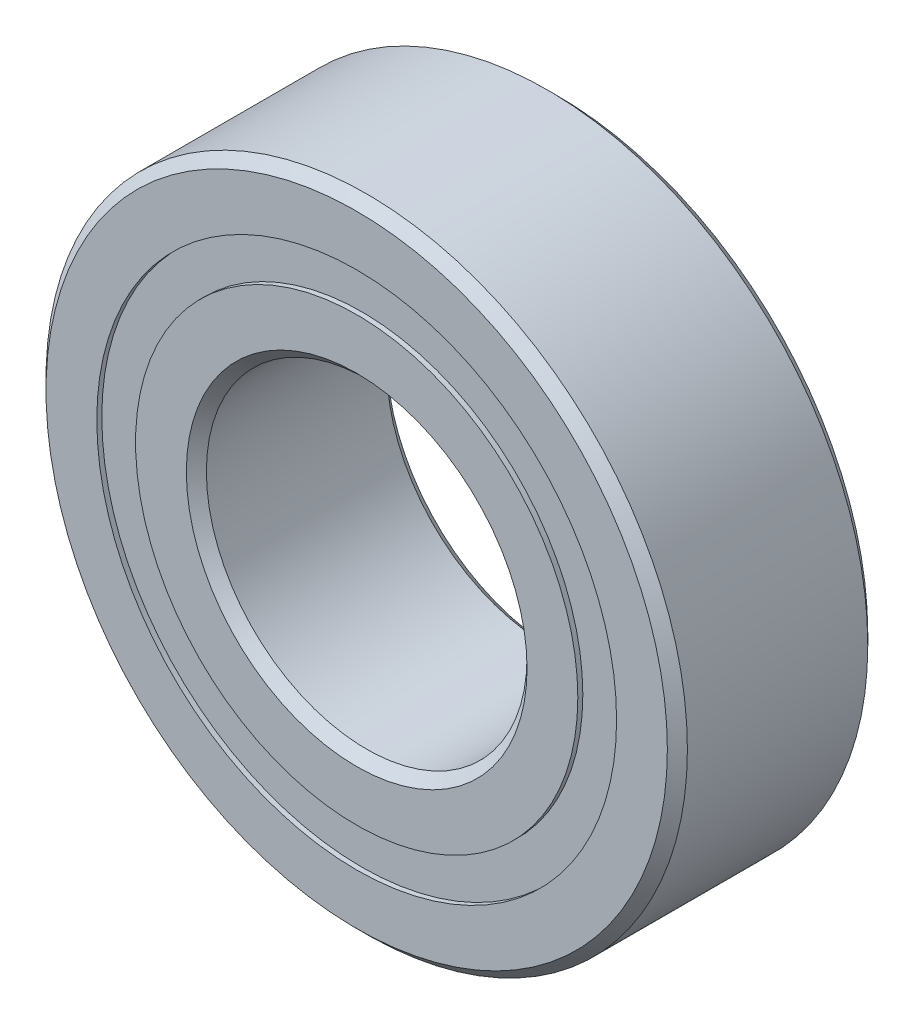
ISO-10303-21;
HEADER;
FILE_DESCRIPTION(('STEP AP214'),'2;1');
FILE_NAME('part.step','',(''),(''),'','','');
FILE_SCHEMA(('AUTOMOTIVE_DESIGN { 1 0 10303 214 1 1 1 1 }'));
ENDSEC;
DATA;
#1=APPLICATION_CONTEXT('core data for automotive mechanical design processes');
#2=APPLICATION_PROTOCOL_DEFINITION('international standard','automotive_design',2000,#1);
#3=PRODUCT_CONTEXT('',#1,'mechanical');
#4=PRODUCT('Part','Part','',(#3));
#5=PRODUCT_RELATED_PRODUCT_CATEGORY('part','',(#4));
#6=PRODUCT_DEFINITION_FORMATION('','',#4);
#7=PRODUCT_DEFINITION_CONTEXT('part definition',#1,'design');
#8=PRODUCT_DEFINITION('design','',#6,#7);
#9=PRODUCT_DEFINITION_SHAPE('','',#8);
#10=(LENGTH_UNIT() NAMED_UNIT(*) SI_UNIT(.MILLI.,.METRE.));
#11=(NAMED_UNIT(*) PLANE_ANGLE_UNIT() SI_UNIT($,.RADIAN.));
#12=(NAMED_UNIT(*) SI_UNIT($,.STERADIAN.) SOLID_ANGLE_UNIT());
#13=UNCERTAINTY_MEASURE_WITH_UNIT(LENGTH_MEASURE(1.E-05),#10,'distance_accuracy_value','');
#14=(GEOMETRIC_REPRESENTATION_CONTEXT(3) GLOBAL_UNCERTAINTY_ASSIGNED_CONTEXT((#13)) GLOBAL_UNIT_ASSIGNED_CONTEXT((#10,
#11,#12)) REPRESENTATION_CONTEXT('',''));
#15=CARTESIAN_POINT('',(0.,0.,0.));
#16=DIRECTION('',(0.,0.,1.));
#17=DIRECTION('',(1.,0.,0.));
#18=AXIS2_PLACEMENT_3D('',#15,#16,#17);
#19=CARTESIAN_POINT('',(0.,6.48351648351649,-2.375));
#20=DIRECTION('',(0.,0.,1.));
#21=DIRECTION('',(1.,0.,0.));
#22=AXIS2_PLACEMENT_3D('',#19,#20,#21);
#23=PLANE('',#22);
#24=CARTESIAN_POINT('',(0.,0.,-2.375));
#25=DIRECTION('',(0.,0.,1.));
#26=DIRECTION('',(1.,0.,0.));
#27=AXIS2_PLACEMENT_3D('',#24,#25,#26);
#28=CIRCLE('',#27,6.48351648351649);
#29=CARTESIAN_POINT('',(6.48351648351649,0.,-2.375));
#30=VERTEX_POINT('',#29);
#31=EDGE_CURVE('E57',#30,#30,#28,.T.);
#32=ORIENTED_EDGE('',*,*,#31,.F.);
#33=EDGE_LOOP('',(#32));
#34=FACE_BOUND('',#33,.T.);
#35=CARTESIAN_POINT('',(0.,0.,-2.375));
#36=DIRECTION('',(0.,0.,1.));
#37=DIRECTION('',(1.,0.,0.));
#38=AXIS2_PLACEMENT_3D('',#35,#36,#37);
#39=CIRCLE('',#38,5.51648351648352);
#40=CARTESIAN_POINT('',(5.51648351648352,0.,-2.375));
#41=VERTEX_POINT('',#40);
#42=EDGE_CURVE('E11',#41,#41,#39,.T.);
#43=ORIENTED_EDGE('',*,*,#42,.T.);
#44=EDGE_LOOP('',(#43));
#45=FACE_BOUND('',#44,.T.);
#46=ADVANCED_FACE('F43',(#34,#45),#23,.F.);
#47=CARTESIAN_POINT('',(0.,0.,2.5));
#48=DIRECTION('',(0.,0.,1.));
#49=DIRECTION('',(1.,0.,0.));
#50=AXIS2_PLACEMENT_3D('',#47,#48,#49);
#51=CYLINDRICAL_SURFACE('',#50,5.51648351648352);
#52=ORIENTED_EDGE('',*,*,#42,.F.);
#53=EDGE_LOOP('',(#52));
#54=FACE_BOUND('',#53,.T.);
#55=CARTESIAN_POINT('',(0.,0.,-1.21175743903915));
#56=DIRECTION('',(0.,0.,1.));
#57=DIRECTION('',(1.,0.,0.));
#58=AXIS2_PLACEMENT_3D('',#55,#56,#57);
#59=CIRCLE('',#58,5.51648351648352);
#60=CARTESIAN_POINT('',(5.51648351648352,0.,-1.21175743903915));
#61=VERTEX_POINT('',#60);
#62=EDGE_CURVE('E49',#61,#61,#59,.T.);
#63=ORIENTED_EDGE('',*,*,#62,.T.);
#64=EDGE_LOOP('',(#63));
#65=FACE_BOUND('',#64,.T.);
#66=ADVANCED_FACE('F66',(#54,#65),#51,.F.);
#67=CARTESIAN_POINT('',(0.,6.48351648351648,-1.21175743903915));
#68=DIRECTION('',(0.,0.,-1.));
#69=DIRECTION('',(-1.,0.,0.));
#70=AXIS2_PLACEMENT_3D('',#67,#68,#69);
#71=PLANE('',#70);
#72=ORIENTED_EDGE('',*,*,#62,.F.);
#73=EDGE_LOOP('',(#72));
#74=FACE_BOUND('',#73,.T.);
#75=CARTESIAN_POINT('',(0.,0.,-1.21175743903915));
#76=DIRECTION('',(0.,0.,1.));
#77=DIRECTION('',(1.,0.,0.));
#78=AXIS2_PLACEMENT_3D('',#75,#76,#77);
#79=CIRCLE('',#78,6.48351648351648);
#80=CARTESIAN_POINT('',(6.48351648351648,0.,-1.21175743903915));
#81=VERTEX_POINT('',#80);
#82=EDGE_CURVE('E53',#81,#81,#79,.T.);
#83=ORIENTED_EDGE('',*,*,#82,.T.);
#84=EDGE_LOOP('',(#83));
#85=FACE_BOUND('',#84,.T.);
#86=ADVANCED_FACE('F70',(#74,#85),#71,.F.);
#87=CARTESIAN_POINT('',(0.,0.,2.5));
#88=DIRECTION('',(0.,0.,1.));
#89=DIRECTION('',(1.,0.,0.));
#90=AXIS2_PLACEMENT_3D('',#87,#88,#89);
#91=CYLINDRICAL_SURFACE('',#90,6.48351648351649);
#92=ORIENTED_EDGE('',*,*,#82,.F.);
#93=EDGE_LOOP('',(#92));
#94=FACE_BOUND('',#93,.T.);
#95=ORIENTED_EDGE('',*,*,#31,.T.);
#96=EDGE_LOOP('',(#95));
#97=FACE_BOUND('',#96,.T.);
#98=ADVANCED_FACE('F63',(#94,#97),#91,.T.);
#99=CLOSED_SHELL('',(#46,#66,#86,#98));
#100=MANIFOLD_SOLID_BREP('B2',#99);
#101=CARTESIAN_POINT('',(0.,6.48351648351648,2.375));
#102=DIRECTION('',(0.,0.,-1.));
#103=DIRECTION('',(-1.,0.,0.));
#104=AXIS2_PLACEMENT_3D('',#101,#102,#103);
#105=PLANE('',#104);
#106=CARTESIAN_POINT('',(0.,0.,2.375));
#107=DIRECTION('',(0.,0.,1.));
#108=DIRECTION('',(1.,0.,0.));
#109=AXIS2_PLACEMENT_3D('',#106,#107,#108);
#110=CIRCLE('',#109,5.51648351648352);
#111=CARTESIAN_POINT('',(5.51648351648352,0.,2.375));
#112=VERTEX_POINT('',#111);
#113=EDGE_CURVE('E42',#112,#112,#110,.T.);
#114=ORIENTED_EDGE('',*,*,#113,.F.);
#115=EDGE_LOOP('',(#114));
#116=FACE_BOUND('',#115,.T.);
#117=CARTESIAN_POINT('',(0.,0.,2.375));
#118=DIRECTION('',(0.,0.,1.));
#119=DIRECTION('',(1.,0.,0.));
#120=AXIS2_PLACEMENT_3D('',#117,#118,#119);
#121=CIRCLE('',#120,6.48351648351648);
#122=CARTESIAN_POINT('',(6.48351648351648,0.,2.375));
#123=VERTEX_POINT('',#122);
#124=EDGE_CURVE('E124',#123,#123,#121,.T.);
#125=ORIENTED_EDGE('',*,*,#124,.T.);
#126=EDGE_LOOP('',(#125));
#127=FACE_BOUND('',#126,.T.);
#128=ADVANCED_FACE('F110',(#116,#127),#105,.F.);
#129=CARTESIAN_POINT('',(0.,0.,2.5));
#130=DIRECTION('',(0.,0.,1.));
#131=DIRECTION('',(1.,0.,0.));
#132=AXIS2_PLACEMENT_3D('',#129,#130,#131);
#133=CYLINDRICAL_SURFACE('',#132,5.51648351648352);
#134=CARTESIAN_POINT('',(0.,0.,1.21175743903915));
#135=DIRECTION('',(0.,0.,1.));
#136=DIRECTION('',(1.,0.,0.));
#137=AXIS2_PLACEMENT_3D('',#134,#135,#136);
#138=CIRCLE('',#137,5.51648351648352);
#139=CARTESIAN_POINT('',(5.51648351648352,0.,1.21175743903915));
#140=VERTEX_POINT('',#139);
#141=EDGE_CURVE('E116',#140,#140,#138,.T.);
#142=ORIENTED_EDGE('',*,*,#141,.F.);
#143=EDGE_LOOP('',(#142));
#144=FACE_BOUND('',#143,.T.);
#145=ORIENTED_EDGE('',*,*,#113,.T.);
#146=EDGE_LOOP('',(#145));
#147=FACE_BOUND('',#146,.T.);
#148=ADVANCED_FACE('F139',(#144,#147),#133,.F.);
#149=CARTESIAN_POINT('',(0.,6.48351648351648,1.21175743903915));
#150=DIRECTION('',(0.,0.,1.));
#151=DIRECTION('',(1.,0.,0.));
#152=AXIS2_PLACEMENT_3D('',#149,#150,#151);
#153=PLANE('',#152);
#154=CARTESIAN_POINT('',(0.,0.,1.21175743903915));
#155=DIRECTION('',(0.,0.,1.));
#156=DIRECTION('',(1.,0.,0.));
#157=AXIS2_PLACEMENT_3D('',#154,#155,#156);
#158=CIRCLE('',#157,6.48351648351648);
#159=CARTESIAN_POINT('',(6.48351648351648,0.,1.21175743903915));
#160=VERTEX_POINT('',#159);
#161=EDGE_CURVE('E120',#160,#160,#158,.T.);
#162=ORIENTED_EDGE('',*,*,#161,.F.);
#163=EDGE_LOOP('',(#162));
#164=FACE_BOUND('',#163,.T.);
#165=ORIENTED_EDGE('',*,*,#141,.T.);
#166=EDGE_LOOP('',(#165));
#167=FACE_BOUND('',#166,.T.);
#168=ADVANCED_FACE('F134',(#164,#167),#153,.F.);
#169=CARTESIAN_POINT('',(0.,0.,2.5));
#170=DIRECTION('',(0.,0.,1.));
#171=DIRECTION('',(1.,0.,0.));
#172=AXIS2_PLACEMENT_3D('',#169,#170,#171);
#173=CYLINDRICAL_SURFACE('',#172,6.48351648351648);
#174=ORIENTED_EDGE('',*,*,#124,.F.);
#175=EDGE_LOOP('',(#174));
#176=FACE_BOUND('',#175,.T.);
#177=ORIENTED_EDGE('',*,*,#161,.T.);
#178=EDGE_LOOP('',(#177));
#179=FACE_BOUND('',#178,.T.);
#180=ADVANCED_FACE('F131',(#176,#179),#173,.T.);
#181=CLOSED_SHELL('',(#128,#148,#168,#180));
#182=MANIFOLD_SOLID_BREP('B6',#181);
#183=CARTESIAN_POINT('',(-2.99999999999993,5.19615242270667,0.));
#184=DIRECTION('',(0.,0.,1.));
#185=DIRECTION('',(-0.499999999999989,0.866025403784445,0.));
#186=AXIS2_PLACEMENT_3D('',#183,#184,#185);
#187=SPHERICAL_SURFACE('',#186,1.21175743903915);
#188=CARTESIAN_POINT('',(-2.99999999999993,5.19615242270667,1.21175743903915));
#189=VERTEX_POINT('',#188);
#190=VERTEX_LOOP('',#189);
#191=FACE_BOUND('',#190,.T.);
#192=ADVANCED_FACE('F177',(#191),#187,.T.);
#193=CLOSED_SHELL('',(#192));
#194=MANIFOLD_SOLID_BREP('B37',#193);
#195=CARTESIAN_POINT('',(-5.1961524227066,3.00000000000006,0.));
#196=DIRECTION('',(0.,0.,1.));
#197=DIRECTION('',(-0.866025403784433,0.50000000000001,0.));
#198=AXIS2_PLACEMENT_3D('',#195,#196,#197);
#199=SPHERICAL_SURFACE('',#198,1.21175743903915);
#200=CARTESIAN_POINT('',(-5.1961524227066,3.00000000000006,1.21175743903915));
#201=VERTEX_POINT('',#200);
#202=VERTEX_LOOP('',#201);
#203=FACE_BOUND('',#202,.T.);
#204=ADVANCED_FACE('F197',(#203),#199,.T.);
#205=CLOSED_SHELL('',(#204));
#206=MANIFOLD_SOLID_BREP('B106',#205);
#207=CARTESIAN_POINT('',(-6.,0.,0.));
#208=DIRECTION('',(0.,0.,1.));
#209=DIRECTION('',(-1.,0.,0.));
#210=AXIS2_PLACEMENT_3D('',#207,#208,#209);
#211=SPHERICAL_SURFACE('',#210,1.21175743903915);
#212=CARTESIAN_POINT('',(-6.,0.,1.21175743903915));
#213=VERTEX_POINT('',#212);
#214=VERTEX_LOOP('',#213);
#215=FACE_BOUND('',#214,.T.);
#216=ADVANCED_FACE('F217',(#215),#211,.T.);
#217=CLOSED_SHELL('',(#216));
#218=MANIFOLD_SOLID_BREP('B173',#217);
#219=CARTESIAN_POINT('',(-5.19615242270666,-2.99999999999995,0.));
#220=DIRECTION('',(0.,0.,1.));
#221=DIRECTION('',(-0.866025403784443,-0.499999999999992,0.));
#222=AXIS2_PLACEMENT_3D('',#219,#220,#221);
#223=SPHERICAL_SURFACE('',#222,1.21175743903915);
#224=CARTESIAN_POINT('',(-5.19615242270666,-2.99999999999995,1.21175743903915));
#225=VERTEX_POINT('',#224);
#226=VERTEX_LOOP('',#225);
#227=FACE_BOUND('',#226,.T.);
#228=ADVANCED_FACE('F237',(#227),#223,.T.);
#229=CLOSED_SHELL('',(#228));
#230=MANIFOLD_SOLID_BREP('B193',#229);
#231=CARTESIAN_POINT('',(-3.00000000000004,-5.19615242270661,0.));
#232=DIRECTION('',(0.,0.,1.));
#233=DIRECTION('',(-0.500000000000007,-0.866025403784435,0.));
#234=AXIS2_PLACEMENT_3D('',#231,#232,#233);
#235=SPHERICAL_SURFACE('',#234,1.21175743903915);
#236=CARTESIAN_POINT('',(-3.00000000000004,-5.19615242270661,1.21175743903915));
#237=VERTEX_POINT('',#236);
#238=VERTEX_LOOP('',#237);
#239=FACE_BOUND('',#238,.T.);
#240=ADVANCED_FACE('F257',(#239),#235,.T.);
#241=CLOSED_SHELL('',(#240));
#242=MANIFOLD_SOLID_BREP('B213',#241);
#243=CARTESIAN_POINT('',(0.,-6.,0.));
#244=DIRECTION('',(0.,0.,1.));
#245=DIRECTION('',(0.,-1.,0.));
#246=AXIS2_PLACEMENT_3D('',#243,#244,#245);
#247=SPHERICAL_SURFACE('',#246,1.21175743903915);
#248=CARTESIAN_POINT('',(0.,-6.,1.21175743903915));
#249=VERTEX_POINT('',#248);
#250=VERTEX_LOOP('',#249);
#251=FACE_BOUND('',#250,.T.);
#252=ADVANCED_FACE('F277',(#251),#247,.T.);
#253=CLOSED_SHELL('',(#252));
#254=MANIFOLD_SOLID_BREP('B233',#253);
#255=CARTESIAN_POINT('',(2.99999999999997,-5.19615242270665,0.));
#256=DIRECTION('',(0.,0.,1.));
#257=DIRECTION('',(0.499999999999995,-0.866025403784442,0.));
#258=AXIS2_PLACEMENT_3D('',#255,#256,#257);
#259=SPHERICAL_SURFACE('',#258,1.21175743903915);
#260=CARTESIAN_POINT('',(2.99999999999997,-5.19615242270665,1.21175743903915));
#261=VERTEX_POINT('',#260);
#262=VERTEX_LOOP('',#261);
#263=FACE_BOUND('',#262,.T.);
#264=ADVANCED_FACE('F297',(#263),#259,.T.);
#265=CLOSED_SHELL('',(#264));
#266=MANIFOLD_SOLID_BREP('B253',#265);
#267=CARTESIAN_POINT('',(5.19615242270662,-3.00000000000002,0.));
#268=DIRECTION('',(0.,0.,1.));
#269=DIRECTION('',(0.866025403784436,-0.500000000000004,0.));
#270=AXIS2_PLACEMENT_3D('',#267,#268,#269);
#271=SPHERICAL_SURFACE('',#270,1.21175743903915);
#272=CARTESIAN_POINT('',(5.19615242270662,-3.00000000000002,1.21175743903915));
#273=VERTEX_POINT('',#272);
#274=VERTEX_LOOP('',#273);
#275=FACE_BOUND('',#274,.T.);
#276=ADVANCED_FACE('F317',(#275),#271,.T.);
#277=CLOSED_SHELL('',(#276));
#278=MANIFOLD_SOLID_BREP('B273',#277);
#279=CARTESIAN_POINT('',(6.,0.,0.));
#280=DIRECTION('',(0.,0.,1.));
#281=DIRECTION('',(1.,0.,0.));
#282=AXIS2_PLACEMENT_3D('',#279,#280,#281);
#283=SPHERICAL_SURFACE('',#282,1.21175743903915);
#284=CARTESIAN_POINT('',(6.,0.,1.21175743903915));
#285=VERTEX_POINT('',#284);
#286=VERTEX_LOOP('',#285);
#287=FACE_BOUND('',#286,.T.);
#288=ADVANCED_FACE('F337',(#287),#283,.T.);
#289=CLOSED_SHELL('',(#288));
#290=MANIFOLD_SOLID_BREP('B293',#289);
#291=CARTESIAN_POINT('',(5.19615242270664,2.99999999999999,0.));
#292=DIRECTION('',(0.,0.,1.));
#293=DIRECTION('',(0.86602540378444,0.499999999999998,0.));
#294=AXIS2_PLACEMENT_3D('',#291,#292,#293);
#295=SPHERICAL_SURFACE('',#294,1.21175743903915);
#296=CARTESIAN_POINT('',(5.19615242270664,2.99999999999999,1.21175743903915));
#297=VERTEX_POINT('',#296);
#298=VERTEX_LOOP('',#297);
#299=FACE_BOUND('',#298,.T.);
#300=ADVANCED_FACE('F357',(#299),#295,.T.);
#301=CLOSED_SHELL('',(#300));
#302=MANIFOLD_SOLID_BREP('B313',#301);
#303=CARTESIAN_POINT('',(3.00000000000001,5.19615242270663,0.));
#304=DIRECTION('',(0.,0.,1.));
#305=DIRECTION('',(0.500000000000001,0.866025403784438,0.));
#306=AXIS2_PLACEMENT_3D('',#303,#304,#305);
#307=SPHERICAL_SURFACE('',#306,1.21175743903915);
#308=CARTESIAN_POINT('',(3.00000000000001,5.19615242270663,1.21175743903915));
#309=VERTEX_POINT('',#308);
#310=VERTEX_LOOP('',#309);
#311=FACE_BOUND('',#310,.T.);
#312=ADVANCED_FACE('F377',(#311),#307,.T.);
#313=CLOSED_SHELL('',(#312));
#314=MANIFOLD_SOLID_BREP('B333',#313);
#315=CARTESIAN_POINT('',(0.,6.,0.));
#316=DIRECTION('',(0.,0.,1.));
#317=DIRECTION('',(0.,1.,0.));
#318=AXIS2_PLACEMENT_3D('',#315,#316,#317);
#319=SPHERICAL_SURFACE('',#318,1.21175743903915);
#320=CARTESIAN_POINT('',(0.,6.,1.21175743903915));
#321=VERTEX_POINT('',#320);
#322=VERTEX_LOOP('',#321);
#323=FACE_BOUND('',#322,.T.);
#324=ADVANCED_FACE('F399',(#323),#319,.T.);
#325=CLOSED_SHELL('',(#324));
#326=MANIFOLD_SOLID_BREP('B353',#325);
#327=CARTESIAN_POINT('',(0.,5.51648351648352,2.5));
#328=DIRECTION('',(0.,0.,-1.));
#329=DIRECTION('',(-1.,0.,0.));
#330=AXIS2_PLACEMENT_3D('',#327,#328,#329);
#331=PLANE('',#330);
#332=CARTESIAN_POINT('',(0.,0.,2.5));
#333=DIRECTION('',(0.,0.,1.));
#334=DIRECTION('',(1.,0.,0.));
#335=AXIS2_PLACEMENT_3D('',#332,#333,#334);
#336=CIRCLE('',#335,4.25);
#337=CARTESIAN_POINT('',(4.25,0.,2.5));
#338=VERTEX_POINT('',#337);
#339=EDGE_CURVE('E446',#338,#338,#336,.T.);
#340=ORIENTED_EDGE('',*,*,#339,.F.);
#341=EDGE_LOOP('',(#340));
#342=FACE_BOUND('',#341,.T.);
#343=CARTESIAN_POINT('',(0.,0.,2.5));
#344=DIRECTION('',(0.,0.,1.));
#345=DIRECTION('',(1.,0.,0.));
#346=AXIS2_PLACEMENT_3D('',#343,#344,#345);
#347=CIRCLE('',#346,5.51648351648352);
#348=CARTESIAN_POINT('',(5.51648351648352,0.,2.5));
#349=VERTEX_POINT('',#348);
#350=EDGE_CURVE('E398',#349,#349,#347,.T.);
#351=ORIENTED_EDGE('',*,*,#350,.T.);
#352=EDGE_LOOP('',(#351));
#353=FACE_BOUND('',#352,.T.);
#354=ADVANCED_FACE('F418',(#342,#353),#331,.F.);
#355=CARTESIAN_POINT('',(0.,0.,2.5));
#356=DIRECTION('',(0.,0.,1.));
#357=DIRECTION('',(1.,0.,0.));
#358=AXIS2_PLACEMENT_3D('',#355,#356,#357);
#359=CYLINDRICAL_SURFACE('',#358,5.51648351648352);
#360=ORIENTED_EDGE('',*,*,#350,.F.);
#361=EDGE_LOOP('',(#360));
#362=FACE_BOUND('',#361,.T.);
#363=CARTESIAN_POINT('',(0.,0.,1.11111111111111));
#364=DIRECTION('',(0.,0.,1.));
#365=DIRECTION('',(1.,0.,0.));
#366=AXIS2_PLACEMENT_3D('',#363,#364,#365);
#367=CIRCLE('',#366,5.51648351648352);
#368=CARTESIAN_POINT('',(5.51648351648352,0.,1.11111111111111));
#369=VERTEX_POINT('',#368);
#370=EDGE_CURVE('E424',#369,#369,#367,.T.);
#371=ORIENTED_EDGE('',*,*,#370,.T.);
#372=EDGE_LOOP('',(#371));
#373=FACE_BOUND('',#372,.T.);
#374=ADVANCED_FACE('F453',(#362,#373),#359,.T.);
#375=CARTESIAN_POINT('',(0.,0.,0.));
#376=DIRECTION('',(0.,0.,1.));
#377=DIRECTION('',(1.,0.,0.));
#378=AXIS2_PLACEMENT_3D('',#375,#376,#377);
#379=TOROIDAL_SURFACE('',#378,6.,1.21175743903915);
#380=ORIENTED_EDGE('',*,*,#370,.F.);
#381=EDGE_LOOP('',(#380));
#382=FACE_BOUND('',#381,.T.);
#383=CARTESIAN_POINT('',(0.,0.,-1.11111111111111));
#384=DIRECTION('',(0.,0.,1.));
#385=DIRECTION('',(1.,0.,0.));
#386=AXIS2_PLACEMENT_3D('',#383,#384,#385);
#387=CIRCLE('',#386,5.51648351648352);
#388=CARTESIAN_POINT('',(5.51648351648352,0.,-1.11111111111111));
#389=VERTEX_POINT('',#388);
#390=EDGE_CURVE('E428',#389,#389,#387,.T.);
#391=ORIENTED_EDGE('',*,*,#390,.T.);
#392=EDGE_LOOP('',(#391));
#393=FACE_BOUND('',#392,.T.);
#394=ADVANCED_FACE('F457',(#382,#393),#379,.F.);
#395=CARTESIAN_POINT('',(0.,0.,2.5));
#396=DIRECTION('',(0.,0.,1.));
#397=DIRECTION('',(1.,0.,0.));
#398=AXIS2_PLACEMENT_3D('',#395,#396,#397);
#399=CYLINDRICAL_SURFACE('',#398,5.51648351648352);
#400=ORIENTED_EDGE('',*,*,#390,.F.);
#401=EDGE_LOOP('',(#400));
#402=FACE_BOUND('',#401,.T.);
#403=CARTESIAN_POINT('',(0.,0.,-2.5));
#404=DIRECTION('',(0.,0.,1.));
#405=DIRECTION('',(1.,0.,0.));
#406=AXIS2_PLACEMENT_3D('',#403,#404,#405);
#407=CIRCLE('',#406,5.51648351648352);
#408=CARTESIAN_POINT('',(5.51648351648352,0.,-2.5));
#409=VERTEX_POINT('',#408);
#410=EDGE_CURVE('E432',#409,#409,#407,.T.);
#411=ORIENTED_EDGE('',*,*,#410,.T.);
#412=EDGE_LOOP('',(#411));
#413=FACE_BOUND('',#412,.T.);
#414=ADVANCED_FACE('F462',(#402,#413),#399,.T.);
#415=CARTESIAN_POINT('',(0.,4.25,-2.5));
#416=DIRECTION('',(0.,0.,1.));
#417=DIRECTION('',(1.,0.,0.));
#418=AXIS2_PLACEMENT_3D('',#415,#416,#417);
#419=PLANE('',#418);
#420=ORIENTED_EDGE('',*,*,#410,.F.);
#421=EDGE_LOOP('',(#420));
#422=FACE_BOUND('',#421,.T.);
#423=CARTESIAN_POINT('',(0.,0.,-2.5));
#424=DIRECTION('',(0.,0.,1.));
#425=DIRECTION('',(1.,0.,0.));
#426=AXIS2_PLACEMENT_3D('',#423,#424,#425);
#427=CIRCLE('',#426,4.25);
#428=CARTESIAN_POINT('',(4.25,0.,-2.5));
#429=VERTEX_POINT('',#428);
#430=EDGE_CURVE('E437',#429,#429,#427,.T.);
#431=ORIENTED_EDGE('',*,*,#430,.T.);
#432=EDGE_LOOP('',(#431));
#433=FACE_BOUND('',#432,.T.);
#434=ADVANCED_FACE('F468',(#422,#433),#419,.F.);
#435=CARTESIAN_POINT('',(0.,0.,-2.25));
#436=DIRECTION('',(0.,0.,-1.));
#437=DIRECTION('',(-1.,0.,0.));
#438=AXIS2_PLACEMENT_3D('',#435,#436,#437);
#439=CONICAL_SURFACE('',#438,4.,0.785398163397443);
#440=ORIENTED_EDGE('',*,*,#430,.F.);
#441=EDGE_LOOP('',(#440));
#442=FACE_BOUND('',#441,.T.);
#443=CARTESIAN_POINT('',(0.,0.,-2.25));
#444=DIRECTION('',(0.,0.,1.));
#445=DIRECTION('',(1.,0.,0.));
#446=AXIS2_PLACEMENT_3D('',#443,#444,#445);
#447=CIRCLE('',#446,4.);
#448=CARTESIAN_POINT('',(4.,0.,-2.25));
#449=VERTEX_POINT('',#448);
#450=EDGE_CURVE('E440',#449,#449,#447,.T.);
#451=ORIENTED_EDGE('',*,*,#450,.T.);
#452=EDGE_LOOP('',(#451));
#453=FACE_BOUND('',#452,.T.);
#454=ADVANCED_FACE('F472',(#442,#453),#439,.F.);
#455=CARTESIAN_POINT('',(0.,0.,2.5));
#456=DIRECTION('',(0.,0.,1.));
#457=DIRECTION('',(1.,0.,0.));
#458=AXIS2_PLACEMENT_3D('',#455,#456,#457);
#459=CYLINDRICAL_SURFACE('',#458,4.);
#460=ORIENTED_EDGE('',*,*,#450,.F.);
#461=EDGE_LOOP('',(#460));
#462=FACE_BOUND('',#461,.T.);
#463=CARTESIAN_POINT('',(0.,0.,2.25));
#464=DIRECTION('',(0.,0.,1.));
#465=DIRECTION('',(1.,0.,0.));
#466=AXIS2_PLACEMENT_3D('',#463,#464,#465);
#467=CIRCLE('',#466,4.);
#468=CARTESIAN_POINT('',(4.,0.,2.25));
#469=VERTEX_POINT('',#468);
#470=EDGE_CURVE('E443',#469,#469,#467,.T.);
#471=ORIENTED_EDGE('',*,*,#470,.T.);
#472=EDGE_LOOP('',(#471));
#473=FACE_BOUND('',#472,.T.);
#474=ADVANCED_FACE('F476',(#462,#473),#459,.F.);
#475=CARTESIAN_POINT('',(0.,0.,2.5));
#476=DIRECTION('',(0.,0.,1.));
#477=DIRECTION('',(1.,0.,0.));
#478=AXIS2_PLACEMENT_3D('',#475,#476,#477);
#479=CONICAL_SURFACE('',#478,4.25,0.785398163397453);
#480=ORIENTED_EDGE('',*,*,#470,.F.);
#481=EDGE_LOOP('',(#480));
#482=FACE_BOUND('',#481,.T.);
#483=ORIENTED_EDGE('',*,*,#339,.T.);
#484=EDGE_LOOP('',(#483));
#485=FACE_BOUND('',#484,.T.);
#486=ADVANCED_FACE('F450',(#482,#485),#479,.F.);
#487=CLOSED_SHELL('',(#354,#374,#394,#414,#434,#454,#474,#486));
#488=MANIFOLD_SOLID_BREP('B373',#487);
#489=CARTESIAN_POINT('',(0.,0.,2.25));
#490=DIRECTION('',(0.,0.,-1.));
#491=DIRECTION('',(-1.,0.,0.));
#492=AXIS2_PLACEMENT_3D('',#489,#490,#491);
#493=CONICAL_SURFACE('',#492,8.,0.785398163397446);
#494=CARTESIAN_POINT('',(0.,0.,2.5));
#495=DIRECTION('',(0.,0.,1.));
#496=DIRECTION('',(1.,0.,0.));
#497=AXIS2_PLACEMENT_3D('',#494,#495,#496);
#498=CIRCLE('',#497,7.75);
#499=CARTESIAN_POINT('',(7.75,0.,2.5));
#500=VERTEX_POINT('',#499);
#501=EDGE_CURVE('E567',#500,#500,#498,.T.);
#502=ORIENTED_EDGE('',*,*,#501,.F.);
#503=EDGE_LOOP('',(#502));
#504=FACE_BOUND('',#503,.T.);
#505=CARTESIAN_POINT('',(0.,0.,2.25));
#506=DIRECTION('',(0.,0.,1.));
#507=DIRECTION('',(1.,0.,0.));
#508=AXIS2_PLACEMENT_3D('',#505,#506,#507);
#509=CIRCLE('',#508,8.);
#510=CARTESIAN_POINT('',(8.,0.,2.25));
#511=VERTEX_POINT('',#510);
#512=EDGE_CURVE('E417',#511,#511,#509,.T.);
#513=ORIENTED_EDGE('',*,*,#512,.T.);
#514=EDGE_LOOP('',(#513));
#515=FACE_BOUND('',#514,.T.);
#516=ADVANCED_FACE('F539',(#504,#515),#493,.T.);
#517=CARTESIAN_POINT('',(0.,0.,2.5));
#518=DIRECTION('',(0.,0.,1.));
#519=DIRECTION('',(1.,0.,0.));
#520=AXIS2_PLACEMENT_3D('',#517,#518,#519);
#521=CYLINDRICAL_SURFACE('',#520,8.);
#522=ORIENTED_EDGE('',*,*,#512,.F.);
#523=EDGE_LOOP('',(#522));
#524=FACE_BOUND('',#523,.T.);
#525=CARTESIAN_POINT('',(0.,0.,-2.25));
#526=DIRECTION('',(0.,0.,1.));
#527=DIRECTION('',(1.,0.,0.));
#528=AXIS2_PLACEMENT_3D('',#525,#526,#527);
#529=CIRCLE('',#528,8.);
#530=CARTESIAN_POINT('',(8.,0.,-2.25));
#531=VERTEX_POINT('',#530);
#532=EDGE_CURVE('E545',#531,#531,#529,.T.);
#533=ORIENTED_EDGE('',*,*,#532,.T.);
#534=EDGE_LOOP('',(#533));
#535=FACE_BOUND('',#534,.T.);
#536=ADVANCED_FACE('F574',(#524,#535),#521,.T.);
#537=CARTESIAN_POINT('',(0.,0.,-2.5));
#538=DIRECTION('',(0.,0.,1.));
#539=DIRECTION('',(1.,0.,0.));
#540=AXIS2_PLACEMENT_3D('',#537,#538,#539);
#541=CONICAL_SURFACE('',#540,7.75,0.785398163397443);
#542=ORIENTED_EDGE('',*,*,#532,.F.);
#543=EDGE_LOOP('',(#542));
#544=FACE_BOUND('',#543,.T.);
#545=CARTESIAN_POINT('',(0.,0.,-2.5));
#546=DIRECTION('',(0.,0.,1.));
#547=DIRECTION('',(1.,0.,0.));
#548=AXIS2_PLACEMENT_3D('',#545,#546,#547);
#549=CIRCLE('',#548,7.75);
#550=CARTESIAN_POINT('',(7.75,0.,-2.5));
#551=VERTEX_POINT('',#550);
#552=EDGE_CURVE('E549',#551,#551,#549,.T.);
#553=ORIENTED_EDGE('',*,*,#552,.T.);
#554=EDGE_LOOP('',(#553));
#555=FACE_BOUND('',#554,.T.);
#556=ADVANCED_FACE('F578',(#544,#555),#541,.T.);
#557=CARTESIAN_POINT('',(0.,7.75,-2.5));
#558=DIRECTION('',(0.,0.,1.));
#559=DIRECTION('',(1.,0.,0.));
#560=AXIS2_PLACEMENT_3D('',#557,#558,#559);
#561=PLANE('',#560);
#562=ORIENTED_EDGE('',*,*,#552,.F.);
#563=EDGE_LOOP('',(#562));
#564=FACE_BOUND('',#563,.T.);
#565=CARTESIAN_POINT('',(0.,0.,-2.5));
#566=DIRECTION('',(0.,0.,1.));
#567=DIRECTION('',(1.,0.,0.));
#568=AXIS2_PLACEMENT_3D('',#565,#566,#567);
#569=CIRCLE('',#568,6.48351648351648);
#570=CARTESIAN_POINT('',(6.48351648351648,0.,-2.5));
#571=VERTEX_POINT('',#570);
#572=EDGE_CURVE('E553',#571,#571,#569,.T.);
#573=ORIENTED_EDGE('',*,*,#572,.T.);
#574=EDGE_LOOP('',(#573));
#575=FACE_BOUND('',#574,.T.);
#576=ADVANCED_FACE('F583',(#564,#575),#561,.F.);
#577=CARTESIAN_POINT('',(0.,0.,2.5));
#578=DIRECTION('',(0.,0.,1.));
#579=DIRECTION('',(1.,0.,0.));
#580=AXIS2_PLACEMENT_3D('',#577,#578,#579);
#581=CYLINDRICAL_SURFACE('',#580,6.48351648351648);
#582=ORIENTED_EDGE('',*,*,#572,.F.);
#583=EDGE_LOOP('',(#582));
#584=FACE_BOUND('',#583,.T.);
#585=CARTESIAN_POINT('',(0.,0.,-1.11111111111111));
#586=DIRECTION('',(0.,0.,1.));
#587=DIRECTION('',(1.,0.,0.));
#588=AXIS2_PLACEMENT_3D('',#585,#586,#587);
#589=CIRCLE('',#588,6.48351648351648);
#590=CARTESIAN_POINT('',(6.48351648351648,0.,-1.11111111111111));
#591=VERTEX_POINT('',#590);
#592=EDGE_CURVE('E558',#591,#591,#589,.T.);
#593=ORIENTED_EDGE('',*,*,#592,.T.);
#594=EDGE_LOOP('',(#593));
#595=FACE_BOUND('',#594,.T.);
#596=ADVANCED_FACE('F589',(#584,#595),#581,.F.);
#597=CARTESIAN_POINT('',(0.,0.,0.));
#598=DIRECTION('',(0.,0.,1.));
#599=DIRECTION('',(1.,0.,0.));
#600=AXIS2_PLACEMENT_3D('',#597,#598,#599);
#601=TOROIDAL_SURFACE('',#600,6.,1.21175743903915);
#602=ORIENTED_EDGE('',*,*,#592,.F.);
#603=EDGE_LOOP('',(#602));
#604=FACE_BOUND('',#603,.T.);
#605=CARTESIAN_POINT('',(0.,0.,1.11111111111111));
#606=DIRECTION('',(0.,0.,1.));
#607=DIRECTION('',(1.,0.,0.));
#608=AXIS2_PLACEMENT_3D('',#605,#606,#607);
#609=CIRCLE('',#608,6.48351648351648);
#610=CARTESIAN_POINT('',(6.48351648351648,0.,1.11111111111111));
#611=VERTEX_POINT('',#610);
#612=EDGE_CURVE('E561',#611,#611,#609,.T.);
#613=ORIENTED_EDGE('',*,*,#612,.T.);
#614=EDGE_LOOP('',(#613));
#615=FACE_BOUND('',#614,.T.);
#616=ADVANCED_FACE('F593',(#604,#615),#601,.F.);
#617=CARTESIAN_POINT('',(0.,0.,2.5));
#618=DIRECTION('',(0.,0.,1.));
#619=DIRECTION('',(1.,0.,0.));
#620=AXIS2_PLACEMENT_3D('',#617,#618,#619);
#621=CYLINDRICAL_SURFACE('',#620,6.48351648351648);
#622=ORIENTED_EDGE('',*,*,#612,.F.);
#623=EDGE_LOOP('',(#622));
#624=FACE_BOUND('',#623,.T.);
#625=CARTESIAN_POINT('',(0.,0.,2.5));
#626=DIRECTION('',(0.,0.,1.));
#627=DIRECTION('',(1.,0.,0.));
#628=AXIS2_PLACEMENT_3D('',#625,#626,#627);
#629=CIRCLE('',#628,6.48351648351648);
#630=CARTESIAN_POINT('',(6.48351648351648,0.,2.5));
#631=VERTEX_POINT('',#630);
#632=EDGE_CURVE('E564',#631,#631,#629,.T.);
#633=ORIENTED_EDGE('',*,*,#632,.T.);
#634=EDGE_LOOP('',(#633));
#635=FACE_BOUND('',#634,.T.);
#636=ADVANCED_FACE('F597',(#624,#635),#621,.F.);
#637=CARTESIAN_POINT('',(0.,7.75,2.5));
#638=DIRECTION('',(0.,0.,-1.));
#639=DIRECTION('',(-1.,0.,0.));
#640=AXIS2_PLACEMENT_3D('',#637,#638,#639);
#641=PLANE('',#640);
#642=ORIENTED_EDGE('',*,*,#632,.F.);
#643=EDGE_LOOP('',(#642));
#644=FACE_BOUND('',#643,.T.);
#645=ORIENTED_EDGE('',*,*,#501,.T.);
#646=EDGE_LOOP('',(#645));
#647=FACE_BOUND('',#646,.T.);
#648=ADVANCED_FACE('F571',(#644,#647),#641,.F.);
#649=CLOSED_SHELL('',(#516,#536,#556,#576,#596,#616,#636,#648));
#650=MANIFOLD_SOLID_BREP('B393',#649);
#651=ADVANCED_BREP_SHAPE_REPRESENTATION('',(#18,#100,#182,#194,#206,#218,#230,#242,#254,#266,
#278,#290,#302,#314,#326,#488,#650),#14);
#652=SHAPE_DEFINITION_REPRESENTATION(#9,#651);
ENDSEC;
END-ISO-10303-21;
